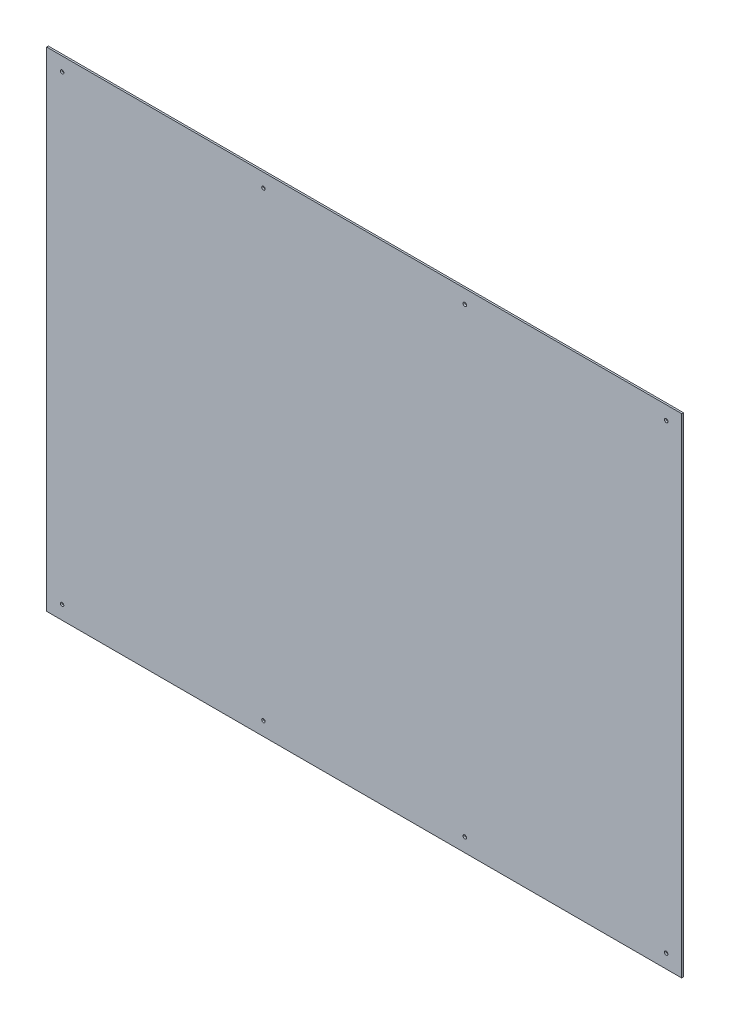
ISO-10303-21;
HEADER;
FILE_DESCRIPTION(('STEP AP214'),'2;1');
FILE_NAME('part.step','',(''),(''),'','','');
FILE_SCHEMA(('AUTOMOTIVE_DESIGN { 1 0 10303 214 1 1 1 1 }'));
ENDSEC;
DATA;
#1=APPLICATION_CONTEXT('core data for automotive mechanical design processes');
#2=APPLICATION_PROTOCOL_DEFINITION('international standard','automotive_design',2000,#1);
#3=PRODUCT_CONTEXT('',#1,'mechanical');
#4=PRODUCT('Part','Part','',(#3));
#5=PRODUCT_RELATED_PRODUCT_CATEGORY('part','',(#4));
#6=PRODUCT_DEFINITION_FORMATION('','',#4);
#7=PRODUCT_DEFINITION_CONTEXT('part definition',#1,'design');
#8=PRODUCT_DEFINITION('design','',#6,#7);
#9=PRODUCT_DEFINITION_SHAPE('','',#8);
#10=(LENGTH_UNIT() NAMED_UNIT(*) SI_UNIT(.MILLI.,.METRE.));
#11=(NAMED_UNIT(*) PLANE_ANGLE_UNIT() SI_UNIT($,.RADIAN.));
#12=(NAMED_UNIT(*) SI_UNIT($,.STERADIAN.) SOLID_ANGLE_UNIT());
#13=UNCERTAINTY_MEASURE_WITH_UNIT(LENGTH_MEASURE(1.E-05),#10,'distance_accuracy_value','');
#14=(GEOMETRIC_REPRESENTATION_CONTEXT(3) GLOBAL_UNCERTAINTY_ASSIGNED_CONTEXT((#13)) GLOBAL_UNIT_ASSIGNED_CONTEXT((#10,
#11,#12)) REPRESENTATION_CONTEXT('',''));
#15=CARTESIAN_POINT('',(0.,0.,0.));
#16=DIRECTION('',(0.,0.,1.));
#17=DIRECTION('',(1.,0.,0.));
#18=AXIS2_PLACEMENT_3D('',#15,#16,#17);
#19=CARTESIAN_POINT('',(557.2125,-425.45,3.175));
#20=DIRECTION('',(0.,0.,1.));
#21=DIRECTION('',(1.,0.,0.));
#22=AXIS2_PLACEMENT_3D('',#19,#20,#21);
#23=CYLINDRICAL_SURFACE('',#22,3.17500000000004);
#24=CARTESIAN_POINT('',(557.2125,-425.45,0.));
#25=DIRECTION('',(0.,0.,1.));
#26=DIRECTION('',(1.,0.,0.));
#27=AXIS2_PLACEMENT_3D('',#24,#25,#26);
#28=CIRCLE('',#27,3.17500000000004);
#29=CARTESIAN_POINT('',(560.3875,-425.45,0.));
#30=VERTEX_POINT('',#29);
#31=EDGE_CURVE('E40',#30,#30,#28,.T.);
#32=ORIENTED_EDGE('',*,*,#31,.F.);
#33=EDGE_LOOP('',(#32));
#34=FACE_BOUND('',#33,.T.);
#35=CARTESIAN_POINT('',(557.2125,-425.45,3.175));
#36=DIRECTION('',(0.,0.,1.));
#37=DIRECTION('',(1.,0.,0.));
#38=AXIS2_PLACEMENT_3D('',#35,#36,#37);
#39=CIRCLE('',#38,3.17500000000004);
#40=CARTESIAN_POINT('',(560.3875,-425.45,3.175));
#41=VERTEX_POINT('',#40);
#42=EDGE_CURVE('E11',#41,#41,#39,.T.);
#43=ORIENTED_EDGE('',*,*,#42,.T.);
#44=EDGE_LOOP('',(#43));
#45=FACE_BOUND('',#44,.T.);
#46=ADVANCED_FACE('F32',(#34,#45),#23,.F.);
#47=CARTESIAN_POINT('',(185.7375,-425.45,3.175));
#48=DIRECTION('',(0.,0.,1.));
#49=DIRECTION('',(1.,0.,0.));
#50=AXIS2_PLACEMENT_3D('',#47,#48,#49);
#51=CYLINDRICAL_SURFACE('',#50,3.17500000000004);
#52=CARTESIAN_POINT('',(185.7375,-425.45,0.));
#53=DIRECTION('',(0.,0.,1.));
#54=DIRECTION('',(1.,0.,0.));
#55=AXIS2_PLACEMENT_3D('',#52,#53,#54);
#56=CIRCLE('',#55,3.17500000000004);
#57=CARTESIAN_POINT('',(188.9125,-425.45,0.));
#58=VERTEX_POINT('',#57);
#59=EDGE_CURVE('E134',#58,#58,#56,.T.);
#60=ORIENTED_EDGE('',*,*,#59,.F.);
#61=EDGE_LOOP('',(#60));
#62=FACE_BOUND('',#61,.T.);
#63=CARTESIAN_POINT('',(185.7375,-425.45,3.175));
#64=DIRECTION('',(0.,0.,1.));
#65=DIRECTION('',(1.,0.,0.));
#66=AXIS2_PLACEMENT_3D('',#63,#64,#65);
#67=CIRCLE('',#66,3.17500000000004);
#68=CARTESIAN_POINT('',(188.9125,-425.45,3.175));
#69=VERTEX_POINT('',#68);
#70=EDGE_CURVE('E137',#69,#69,#67,.T.);
#71=ORIENTED_EDGE('',*,*,#70,.T.);
#72=EDGE_LOOP('',(#71));
#73=FACE_BOUND('',#72,.T.);
#74=ADVANCED_FACE('F146',(#62,#73),#51,.F.);
#75=CARTESIAN_POINT('',(-185.7375,-425.45,3.175));
#76=DIRECTION('',(0.,0.,1.));
#77=DIRECTION('',(1.,0.,0.));
#78=AXIS2_PLACEMENT_3D('',#75,#76,#77);
#79=CYLINDRICAL_SURFACE('',#78,3.17500000000004);
#80=CARTESIAN_POINT('',(-185.7375,-425.45,0.));
#81=DIRECTION('',(0.,0.,1.));
#82=DIRECTION('',(1.,0.,0.));
#83=AXIS2_PLACEMENT_3D('',#80,#81,#82);
#84=CIRCLE('',#83,3.17500000000004);
#85=CARTESIAN_POINT('',(-182.5625,-425.45,0.));
#86=VERTEX_POINT('',#85);
#87=EDGE_CURVE('E128',#86,#86,#84,.T.);
#88=ORIENTED_EDGE('',*,*,#87,.F.);
#89=EDGE_LOOP('',(#88));
#90=FACE_BOUND('',#89,.T.);
#91=CARTESIAN_POINT('',(-185.7375,-425.45,3.175));
#92=DIRECTION('',(0.,0.,1.));
#93=DIRECTION('',(1.,0.,0.));
#94=AXIS2_PLACEMENT_3D('',#91,#92,#93);
#95=CIRCLE('',#94,3.17500000000004);
#96=CARTESIAN_POINT('',(-182.5625,-425.45,3.175));
#97=VERTEX_POINT('',#96);
#98=EDGE_CURVE('E131',#97,#97,#95,.T.);
#99=ORIENTED_EDGE('',*,*,#98,.T.);
#100=EDGE_LOOP('',(#99));
#101=FACE_BOUND('',#100,.T.);
#102=ADVANCED_FACE('F185',(#90,#101),#79,.F.);
#103=CARTESIAN_POINT('',(-557.2125,-425.45,3.175));
#104=DIRECTION('',(0.,0.,1.));
#105=DIRECTION('',(1.,0.,0.));
#106=AXIS2_PLACEMENT_3D('',#103,#104,#105);
#107=CYLINDRICAL_SURFACE('',#106,3.17500000000004);
#108=CARTESIAN_POINT('',(-557.2125,-425.45,0.));
#109=DIRECTION('',(0.,0.,1.));
#110=DIRECTION('',(1.,0.,0.));
#111=AXIS2_PLACEMENT_3D('',#108,#109,#110);
#112=CIRCLE('',#111,3.17500000000004);
#113=CARTESIAN_POINT('',(-554.0375,-425.45,0.));
#114=VERTEX_POINT('',#113);
#115=EDGE_CURVE('E122',#114,#114,#112,.T.);
#116=ORIENTED_EDGE('',*,*,#115,.F.);
#117=EDGE_LOOP('',(#116));
#118=FACE_BOUND('',#117,.T.);
#119=CARTESIAN_POINT('',(-557.2125,-425.45,3.175));
#120=DIRECTION('',(0.,0.,1.));
#121=DIRECTION('',(1.,0.,0.));
#122=AXIS2_PLACEMENT_3D('',#119,#120,#121);
#123=CIRCLE('',#122,3.17500000000004);
#124=CARTESIAN_POINT('',(-554.0375,-425.45,3.175));
#125=VERTEX_POINT('',#124);
#126=EDGE_CURVE('E125',#125,#125,#123,.T.);
#127=ORIENTED_EDGE('',*,*,#126,.T.);
#128=EDGE_LOOP('',(#127));
#129=FACE_BOUND('',#128,.T.);
#130=ADVANCED_FACE('F181',(#118,#129),#107,.F.);
#131=CARTESIAN_POINT('',(557.2125,425.45,3.175));
#132=DIRECTION('',(0.,0.,1.));
#133=DIRECTION('',(1.,0.,0.));
#134=AXIS2_PLACEMENT_3D('',#131,#132,#133);
#135=CYLINDRICAL_SURFACE('',#134,3.17500000000004);
#136=CARTESIAN_POINT('',(557.2125,425.45,0.));
#137=DIRECTION('',(0.,0.,1.));
#138=DIRECTION('',(1.,0.,0.));
#139=AXIS2_PLACEMENT_3D('',#136,#137,#138);
#140=CIRCLE('',#139,3.17500000000004);
#141=CARTESIAN_POINT('',(560.3875,425.45,0.));
#142=VERTEX_POINT('',#141);
#143=EDGE_CURVE('E116',#142,#142,#140,.T.);
#144=ORIENTED_EDGE('',*,*,#143,.F.);
#145=EDGE_LOOP('',(#144));
#146=FACE_BOUND('',#145,.T.);
#147=CARTESIAN_POINT('',(557.2125,425.45,3.175));
#148=DIRECTION('',(0.,0.,1.));
#149=DIRECTION('',(1.,0.,0.));
#150=AXIS2_PLACEMENT_3D('',#147,#148,#149);
#151=CIRCLE('',#150,3.17500000000004);
#152=CARTESIAN_POINT('',(560.3875,425.45,3.175));
#153=VERTEX_POINT('',#152);
#154=EDGE_CURVE('E119',#153,#153,#151,.T.);
#155=ORIENTED_EDGE('',*,*,#154,.T.);
#156=EDGE_LOOP('',(#155));
#157=FACE_BOUND('',#156,.T.);
#158=ADVANCED_FACE('F177',(#146,#157),#135,.F.);
#159=CARTESIAN_POINT('',(185.7375,425.45,3.175));
#160=DIRECTION('',(0.,0.,1.));
#161=DIRECTION('',(1.,0.,0.));
#162=AXIS2_PLACEMENT_3D('',#159,#160,#161);
#163=CYLINDRICAL_SURFACE('',#162,3.17500000000004);
#164=CARTESIAN_POINT('',(185.7375,425.45,0.));
#165=DIRECTION('',(0.,0.,1.));
#166=DIRECTION('',(1.,0.,0.));
#167=AXIS2_PLACEMENT_3D('',#164,#165,#166);
#168=CIRCLE('',#167,3.17500000000004);
#169=CARTESIAN_POINT('',(188.9125,425.45,0.));
#170=VERTEX_POINT('',#169);
#171=EDGE_CURVE('E110',#170,#170,#168,.T.);
#172=ORIENTED_EDGE('',*,*,#171,.F.);
#173=EDGE_LOOP('',(#172));
#174=FACE_BOUND('',#173,.T.);
#175=CARTESIAN_POINT('',(185.7375,425.45,3.175));
#176=DIRECTION('',(0.,0.,1.));
#177=DIRECTION('',(1.,0.,0.));
#178=AXIS2_PLACEMENT_3D('',#175,#176,#177);
#179=CIRCLE('',#178,3.17500000000004);
#180=CARTESIAN_POINT('',(188.9125,425.45,3.175));
#181=VERTEX_POINT('',#180);
#182=EDGE_CURVE('E113',#181,#181,#179,.T.);
#183=ORIENTED_EDGE('',*,*,#182,.T.);
#184=EDGE_LOOP('',(#183));
#185=FACE_BOUND('',#184,.T.);
#186=ADVANCED_FACE('F173',(#174,#185),#163,.F.);
#187=CARTESIAN_POINT('',(-585.7875,-450.85,3.175));
#188=DIRECTION('',(1.,0.,0.));
#189=DIRECTION('',(0.,0.,-1.));
#190=AXIS2_PLACEMENT_3D('',#187,#188,#189);
#191=PLANE('',#190);
#192=DIRECTION('',(0.,-1.,0.));
#193=VECTOR('',#192,1.);
#194=CARTESIAN_POINT('',(-585.7875,-450.85,0.));
#195=LINE('',#194,#193);
#196=CARTESIAN_POINT('',(-585.7875,450.85,0.));
#197=VERTEX_POINT('',#196);
#198=CARTESIAN_POINT('',(-585.7875,-450.85,0.));
#199=VERTEX_POINT('',#198);
#200=EDGE_CURVE('E100',#197,#199,#195,.T.);
#201=ORIENTED_EDGE('',*,*,#200,.T.);
#202=DIRECTION('',(0.,0.,-1.));
#203=VECTOR('',#202,1.);
#204=CARTESIAN_POINT('',(-585.7875,-450.85,3.175));
#205=LINE('',#204,#203);
#206=CARTESIAN_POINT('',(-585.7875,-450.85,3.175));
#207=VERTEX_POINT('',#206);
#208=EDGE_CURVE('E91',#207,#199,#205,.T.);
#209=ORIENTED_EDGE('',*,*,#208,.F.);
#210=DIRECTION('',(0.,-1.,0.));
#211=VECTOR('',#210,1.);
#212=CARTESIAN_POINT('',(-585.7875,-450.85,3.175));
#213=LINE('',#212,#211);
#214=CARTESIAN_POINT('',(-585.7875,450.85,3.175));
#215=VERTEX_POINT('',#214);
#216=EDGE_CURVE('E85',#215,#207,#213,.T.);
#217=ORIENTED_EDGE('',*,*,#216,.F.);
#218=DIRECTION('',(0.,0.,-1.));
#219=VECTOR('',#218,1.);
#220=CARTESIAN_POINT('',(-585.7875,450.85,3.175));
#221=LINE('',#220,#219);
#222=EDGE_CURVE('E96',#215,#197,#221,.T.);
#223=ORIENTED_EDGE('',*,*,#222,.T.);
#224=EDGE_LOOP('',(#201,#209,#217,#223));
#225=FACE_BOUND('',#224,.T.);
#226=ADVANCED_FACE('F170',(#225),#191,.F.);
#227=CARTESIAN_POINT('',(585.7875,-450.85,3.175));
#228=DIRECTION('',(0.,1.,0.));
#229=DIRECTION('',(-1.,0.,0.));
#230=AXIS2_PLACEMENT_3D('',#227,#228,#229);
#231=PLANE('',#230);
#232=DIRECTION('',(1.,0.,0.));
#233=VECTOR('',#232,1.);
#234=CARTESIAN_POINT('',(585.7875,-450.85,0.));
#235=LINE('',#234,#233);
#236=CARTESIAN_POINT('',(585.7875,-450.85,0.));
#237=VERTEX_POINT('',#236);
#238=EDGE_CURVE('E90',#199,#237,#235,.T.);
#239=ORIENTED_EDGE('',*,*,#238,.T.);
#240=DIRECTION('',(0.,0.,-1.));
#241=VECTOR('',#240,1.);
#242=CARTESIAN_POINT('',(585.7875,-450.85,3.175));
#243=LINE('',#242,#241);
#244=CARTESIAN_POINT('',(585.7875,-450.85,3.175));
#245=VERTEX_POINT('',#244);
#246=EDGE_CURVE('E88',#245,#237,#243,.T.);
#247=ORIENTED_EDGE('',*,*,#246,.F.);
#248=DIRECTION('',(1.,0.,0.));
#249=VECTOR('',#248,1.);
#250=CARTESIAN_POINT('',(585.7875,-450.85,3.175));
#251=LINE('',#250,#249);
#252=EDGE_CURVE('E79',#207,#245,#251,.T.);
#253=ORIENTED_EDGE('',*,*,#252,.F.);
#254=ORIENTED_EDGE('',*,*,#208,.T.);
#255=EDGE_LOOP('',(#239,#247,#253,#254));
#256=FACE_BOUND('',#255,.T.);
#257=ADVANCED_FACE('F89',(#256),#231,.F.);
#258=CARTESIAN_POINT('',(585.7875,-450.85,3.175));
#259=DIRECTION('',(-1.,0.,0.));
#260=DIRECTION('',(0.,0.,1.));
#261=AXIS2_PLACEMENT_3D('',#258,#259,#260);
#262=PLANE('',#261);
#263=DIRECTION('',(0.,1.,0.));
#264=VECTOR('',#263,1.);
#265=CARTESIAN_POINT('',(585.7875,-450.85,0.));
#266=LINE('',#265,#264);
#267=CARTESIAN_POINT('',(585.7875,450.85,0.));
#268=VERTEX_POINT('',#267);
#269=EDGE_CURVE('E65',#237,#268,#266,.T.);
#270=ORIENTED_EDGE('',*,*,#269,.T.);
#271=DIRECTION('',(0.,0.,-1.));
#272=VECTOR('',#271,1.);
#273=CARTESIAN_POINT('',(585.7875,450.85,3.175));
#274=LINE('',#273,#272);
#275=CARTESIAN_POINT('',(585.7875,450.85,3.175));
#276=VERTEX_POINT('',#275);
#277=EDGE_CURVE('E92',#276,#268,#274,.T.);
#278=ORIENTED_EDGE('',*,*,#277,.F.);
#279=DIRECTION('',(0.,1.,0.));
#280=VECTOR('',#279,1.);
#281=CARTESIAN_POINT('',(585.7875,-450.85,3.175));
#282=LINE('',#281,#280);
#283=EDGE_CURVE('E83',#245,#276,#282,.T.);
#284=ORIENTED_EDGE('',*,*,#283,.F.);
#285=ORIENTED_EDGE('',*,*,#246,.T.);
#286=EDGE_LOOP('',(#270,#278,#284,#285));
#287=FACE_BOUND('',#286,.T.);
#288=ADVANCED_FACE('F94',(#287),#262,.F.);
#289=CARTESIAN_POINT('',(585.7875,450.85,3.175));
#290=DIRECTION('',(0.,-1.,0.));
#291=DIRECTION('',(1.,0.,0.));
#292=AXIS2_PLACEMENT_3D('',#289,#290,#291);
#293=PLANE('',#292);
#294=DIRECTION('',(-1.,0.,0.));
#295=VECTOR('',#294,1.);
#296=CARTESIAN_POINT('',(585.7875,450.85,0.));
#297=LINE('',#296,#295);
#298=EDGE_CURVE('E71',#268,#197,#297,.T.);
#299=ORIENTED_EDGE('',*,*,#298,.T.);
#300=ORIENTED_EDGE('',*,*,#222,.F.);
#301=DIRECTION('',(-1.,0.,0.));
#302=VECTOR('',#301,1.);
#303=CARTESIAN_POINT('',(585.7875,450.85,3.175));
#304=LINE('',#303,#302);
#305=EDGE_CURVE('E48',#276,#215,#304,.T.);
#306=ORIENTED_EDGE('',*,*,#305,.F.);
#307=ORIENTED_EDGE('',*,*,#277,.T.);
#308=EDGE_LOOP('',(#299,#300,#306,#307));
#309=FACE_BOUND('',#308,.T.);
#310=ADVANCED_FACE('F150',(#309),#293,.F.);
#311=CARTESIAN_POINT('',(0.,0.,3.175));
#312=DIRECTION('',(0.,0.,1.));
#313=DIRECTION('',(1.,0.,0.));
#314=AXIS2_PLACEMENT_3D('',#311,#312,#313);
#315=PLANE('',#314);
#316=CARTESIAN_POINT('',(-185.7375,425.45,3.175));
#317=DIRECTION('',(0.,0.,1.));
#318=DIRECTION('',(1.,0.,0.));
#319=AXIS2_PLACEMENT_3D('',#316,#317,#318);
#320=CIRCLE('',#319,3.17500000000004);
#321=CARTESIAN_POINT('',(-182.5625,425.45,3.175));
#322=VERTEX_POINT('',#321);
#323=EDGE_CURVE('E282',#322,#322,#320,.T.);
#324=ORIENTED_EDGE('',*,*,#323,.F.);
#325=EDGE_LOOP('',(#324));
#326=FACE_BOUND('',#325,.T.);
#327=CARTESIAN_POINT('',(-557.2125,425.45,3.175));
#328=DIRECTION('',(0.,0.,1.));
#329=DIRECTION('',(1.,0.,0.));
#330=AXIS2_PLACEMENT_3D('',#327,#328,#329);
#331=CIRCLE('',#330,3.17500000000004);
#332=CARTESIAN_POINT('',(-554.0375,425.45,3.175));
#333=VERTEX_POINT('',#332);
#334=EDGE_CURVE('E283',#333,#333,#331,.T.);
#335=ORIENTED_EDGE('',*,*,#334,.F.);
#336=EDGE_LOOP('',(#335));
#337=FACE_BOUND('',#336,.T.);
#338=ORIENTED_EDGE('',*,*,#216,.T.);
#339=ORIENTED_EDGE('',*,*,#252,.T.);
#340=ORIENTED_EDGE('',*,*,#283,.T.);
#341=ORIENTED_EDGE('',*,*,#305,.T.);
#342=EDGE_LOOP('',(#338,#339,#340,#341));
#343=FACE_BOUND('',#342,.T.);
#344=ORIENTED_EDGE('',*,*,#182,.F.);
#345=EDGE_LOOP('',(#344));
#346=FACE_BOUND('',#345,.T.);
#347=ORIENTED_EDGE('',*,*,#154,.F.);
#348=EDGE_LOOP('',(#347));
#349=FACE_BOUND('',#348,.T.);
#350=ORIENTED_EDGE('',*,*,#126,.F.);
#351=EDGE_LOOP('',(#350));
#352=FACE_BOUND('',#351,.T.);
#353=ORIENTED_EDGE('',*,*,#98,.F.);
#354=EDGE_LOOP('',(#353));
#355=FACE_BOUND('',#354,.T.);
#356=ORIENTED_EDGE('',*,*,#70,.F.);
#357=EDGE_LOOP('',(#356));
#358=FACE_BOUND('',#357,.T.);
#359=ORIENTED_EDGE('',*,*,#42,.F.);
#360=EDGE_LOOP('',(#359));
#361=FACE_BOUND('',#360,.T.);
#362=ADVANCED_FACE('F80',(#326,#337,#343,#346,#349,#352,#355,#358,#361),#315,.T.);
#363=CARTESIAN_POINT('',(0.,0.,0.));
#364=DIRECTION('',(0.,0.,1.));
#365=DIRECTION('',(1.,0.,0.));
#366=AXIS2_PLACEMENT_3D('',#363,#364,#365);
#367=PLANE('',#366);
#368=CARTESIAN_POINT('',(-185.7375,425.45,0.));
#369=DIRECTION('',(0.,0.,1.));
#370=DIRECTION('',(1.,0.,0.));
#371=AXIS2_PLACEMENT_3D('',#368,#369,#370);
#372=CIRCLE('',#371,3.17500000000004);
#373=CARTESIAN_POINT('',(-182.5625,425.45,0.));
#374=VERTEX_POINT('',#373);
#375=EDGE_CURVE('E280',#374,#374,#372,.T.);
#376=ORIENTED_EDGE('',*,*,#375,.T.);
#377=EDGE_LOOP('',(#376));
#378=FACE_BOUND('',#377,.T.);
#379=CARTESIAN_POINT('',(-557.2125,425.45,0.));
#380=DIRECTION('',(0.,0.,1.));
#381=DIRECTION('',(1.,0.,0.));
#382=AXIS2_PLACEMENT_3D('',#379,#380,#381);
#383=CIRCLE('',#382,3.17500000000004);
#384=CARTESIAN_POINT('',(-554.0375,425.45,0.));
#385=VERTEX_POINT('',#384);
#386=EDGE_CURVE('E103',#385,#385,#383,.T.);
#387=ORIENTED_EDGE('',*,*,#386,.T.);
#388=EDGE_LOOP('',(#387));
#389=FACE_BOUND('',#388,.T.);
#390=ORIENTED_EDGE('',*,*,#200,.F.);
#391=ORIENTED_EDGE('',*,*,#298,.F.);
#392=ORIENTED_EDGE('',*,*,#269,.F.);
#393=ORIENTED_EDGE('',*,*,#238,.F.);
#394=EDGE_LOOP('',(#390,#391,#392,#393));
#395=FACE_BOUND('',#394,.T.);
#396=ORIENTED_EDGE('',*,*,#171,.T.);
#397=EDGE_LOOP('',(#396));
#398=FACE_BOUND('',#397,.T.);
#399=ORIENTED_EDGE('',*,*,#143,.T.);
#400=EDGE_LOOP('',(#399));
#401=FACE_BOUND('',#400,.T.);
#402=ORIENTED_EDGE('',*,*,#115,.T.);
#403=EDGE_LOOP('',(#402));
#404=FACE_BOUND('',#403,.T.);
#405=ORIENTED_EDGE('',*,*,#87,.T.);
#406=EDGE_LOOP('',(#405));
#407=FACE_BOUND('',#406,.T.);
#408=ORIENTED_EDGE('',*,*,#59,.T.);
#409=EDGE_LOOP('',(#408));
#410=FACE_BOUND('',#409,.T.);
#411=ORIENTED_EDGE('',*,*,#31,.T.);
#412=EDGE_LOOP('',(#411));
#413=FACE_BOUND('',#412,.T.);
#414=ADVANCED_FACE('F142',(#378,#389,#395,#398,#401,#404,#407,#410,#413),#367,.F.);
#415=CARTESIAN_POINT('',(-557.2125,425.45,3.175));
#416=DIRECTION('',(0.,0.,1.));
#417=DIRECTION('',(1.,0.,0.));
#418=AXIS2_PLACEMENT_3D('',#415,#416,#417);
#419=CYLINDRICAL_SURFACE('',#418,3.17500000000004);
#420=ORIENTED_EDGE('',*,*,#386,.F.);
#421=EDGE_LOOP('',(#420));
#422=FACE_BOUND('',#421,.T.);
#423=ORIENTED_EDGE('',*,*,#334,.T.);
#424=EDGE_LOOP('',(#423));
#425=FACE_BOUND('',#424,.T.);
#426=ADVANCED_FACE('F157',(#422,#425),#419,.F.);
#427=CARTESIAN_POINT('',(-185.7375,425.45,3.175));
#428=DIRECTION('',(0.,0.,1.));
#429=DIRECTION('',(1.,0.,0.));
#430=AXIS2_PLACEMENT_3D('',#427,#428,#429);
#431=CYLINDRICAL_SURFACE('',#430,3.17500000000004);
#432=ORIENTED_EDGE('',*,*,#375,.F.);
#433=EDGE_LOOP('',(#432));
#434=FACE_BOUND('',#433,.T.);
#435=ORIENTED_EDGE('',*,*,#323,.T.);
#436=EDGE_LOOP('',(#435));
#437=FACE_BOUND('',#436,.T.);
#438=ADVANCED_FACE('F241',(#434,#437),#431,.F.);
#439=CLOSED_SHELL('',(#46,#74,#102,#130,#158,#186,#226,#257,#288,#310,#362,#414,#426,#438));
#440=MANIFOLD_SOLID_BREP('B2',#439);
#441=ADVANCED_BREP_SHAPE_REPRESENTATION('',(#18,#440),#14);
#442=SHAPE_DEFINITION_REPRESENTATION(#9,#441);
ENDSEC;
END-ISO-10303-21;
